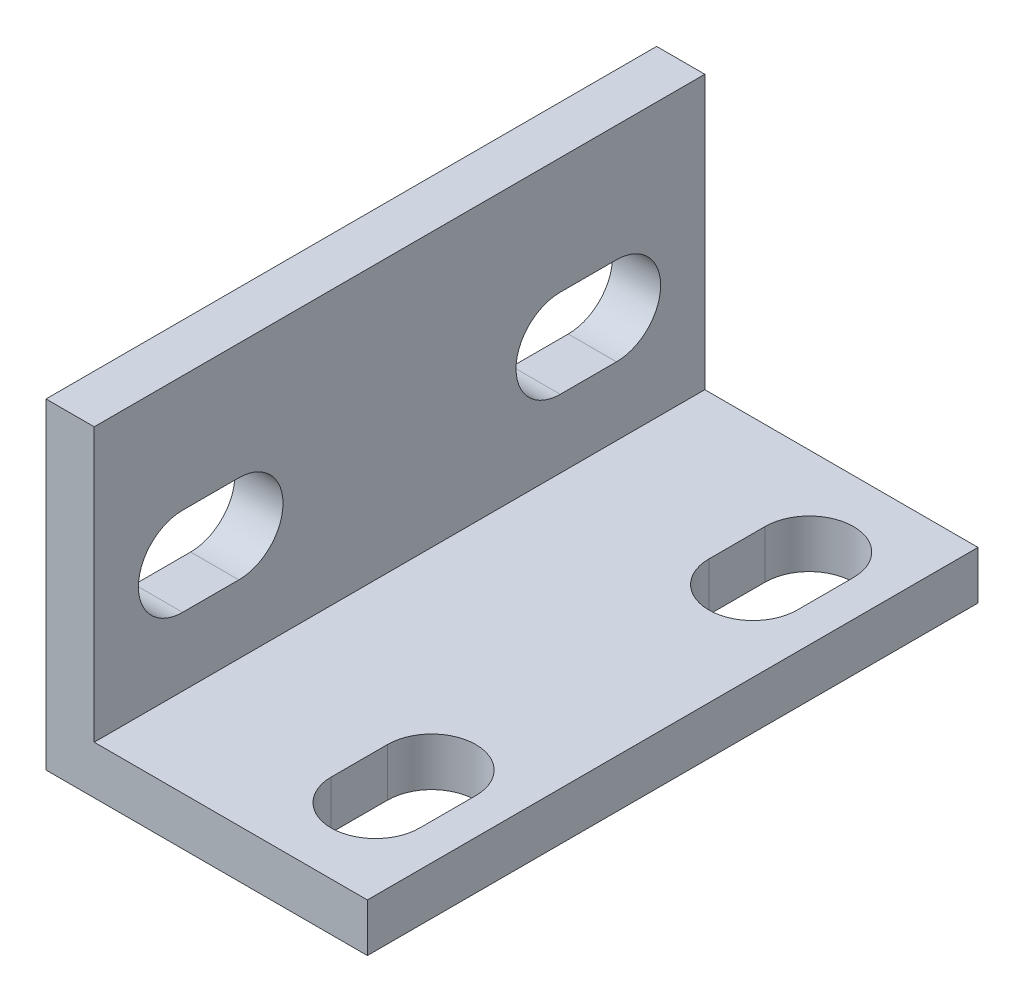
ISO-10303-21;
HEADER;
FILE_DESCRIPTION(('STEP AP214'),'2;1');
FILE_NAME('part.step','',(''),(''),'','','');
FILE_SCHEMA(('AUTOMOTIVE_DESIGN { 1 0 10303 214 1 1 1 1 }'));
ENDSEC;
DATA;
#1=APPLICATION_CONTEXT('core data for automotive mechanical design processes');
#2=APPLICATION_PROTOCOL_DEFINITION('international standard','automotive_design',2000,#1);
#3=PRODUCT_CONTEXT('',#1,'mechanical');
#4=PRODUCT('Part','Part','',(#3));
#5=PRODUCT_RELATED_PRODUCT_CATEGORY('part','',(#4));
#6=PRODUCT_DEFINITION_FORMATION('','',#4);
#7=PRODUCT_DEFINITION_CONTEXT('part definition',#1,'design');
#8=PRODUCT_DEFINITION('design','',#6,#7);
#9=PRODUCT_DEFINITION_SHAPE('','',#8);
#10=(LENGTH_UNIT() NAMED_UNIT(*) SI_UNIT(.MILLI.,.METRE.));
#11=(NAMED_UNIT(*) PLANE_ANGLE_UNIT() SI_UNIT($,.RADIAN.));
#12=(NAMED_UNIT(*) SI_UNIT($,.STERADIAN.) SOLID_ANGLE_UNIT());
#13=UNCERTAINTY_MEASURE_WITH_UNIT(LENGTH_MEASURE(1.E-05),#10,'distance_accuracy_value','');
#14=(GEOMETRIC_REPRESENTATION_CONTEXT(3) GLOBAL_UNCERTAINTY_ASSIGNED_CONTEXT((#13)) GLOBAL_UNIT_ASSIGNED_CONTEXT((#10,
#11,#12)) REPRESENTATION_CONTEXT('',''));
#15=CARTESIAN_POINT('',(0.,0.,0.));
#16=DIRECTION('',(0.,0.,1.));
#17=DIRECTION('',(1.,0.,0.));
#18=AXIS2_PLACEMENT_3D('',#15,#16,#17);
#19=CARTESIAN_POINT('',(12.25,0.,5.5));
#20=DIRECTION('',(-1.,0.,0.));
#21=DIRECTION('',(0.,0.,1.));
#22=AXIS2_PLACEMENT_3D('',#19,#20,#21);
#23=PLANE('',#22);
#24=DIRECTION('',(0.,0.,1.));
#25=VECTOR('',#24,1.);
#26=CARTESIAN_POINT('',(12.25,3.,5.5));
#27=LINE('',#26,#25);
#28=CARTESIAN_POINT('',(12.25,3.,5.5));
#29=VERTEX_POINT('',#28);
#30=CARTESIAN_POINT('',(12.25,3.,9.));
#31=VERTEX_POINT('',#30);
#32=EDGE_CURVE('E339',#29,#31,#27,.T.);
#33=ORIENTED_EDGE('',*,*,#32,.T.);
#34=DIRECTION('',(0.,1.,0.));
#35=VECTOR('',#34,1.);
#36=CARTESIAN_POINT('',(12.25,0.,9.));
#37=LINE('',#36,#35);
#38=CARTESIAN_POINT('',(12.25,0.,9.));
#39=VERTEX_POINT('',#38);
#40=EDGE_CURVE('E11',#39,#31,#37,.T.);
#41=ORIENTED_EDGE('',*,*,#40,.F.);
#42=DIRECTION('',(0.,0.,1.));
#43=VECTOR('',#42,1.);
#44=CARTESIAN_POINT('',(12.25,0.,5.5));
#45=LINE('',#44,#43);
#46=CARTESIAN_POINT('',(12.25,0.,5.5));
#47=VERTEX_POINT('',#46);
#48=EDGE_CURVE('E285',#47,#39,#45,.T.);
#49=ORIENTED_EDGE('',*,*,#48,.F.);
#50=DIRECTION('',(0.,1.,0.));
#51=VECTOR('',#50,1.);
#52=CARTESIAN_POINT('',(12.25,0.,5.5));
#53=LINE('',#52,#51);
#54=EDGE_CURVE('E453',#47,#29,#53,.T.);
#55=ORIENTED_EDGE('',*,*,#54,.T.);
#56=EDGE_LOOP('',(#33,#41,#49,#55));
#57=FACE_BOUND('',#56,.T.);
#58=ADVANCED_FACE('F17',(#57),#23,.F.);
#59=CARTESIAN_POINT('',(15.,0.,9.));
#60=DIRECTION('',(0.,1.,0.));
#61=DIRECTION('',(0.,0.,1.));
#62=AXIS2_PLACEMENT_3D('',#59,#60,#61);
#63=CYLINDRICAL_SURFACE('',#62,2.75);
#64=CARTESIAN_POINT('',(15.,3.,9.));
#65=DIRECTION('',(0.,1.,0.));
#66=DIRECTION('',(0.,0.,-1.));
#67=AXIS2_PLACEMENT_3D('',#64,#65,#66);
#68=CIRCLE('',#67,2.75);
#69=CARTESIAN_POINT('',(17.75,3.,9.));
#70=VERTEX_POINT('',#69);
#71=EDGE_CURVE('E261',#31,#70,#68,.T.);
#72=ORIENTED_EDGE('',*,*,#71,.T.);
#73=DIRECTION('',(0.,1.,0.));
#74=VECTOR('',#73,1.);
#75=CARTESIAN_POINT('',(17.75,0.,9.));
#76=LINE('',#75,#74);
#77=CARTESIAN_POINT('',(17.75,0.,9.));
#78=VERTEX_POINT('',#77);
#79=EDGE_CURVE('E26',#78,#70,#76,.T.);
#80=ORIENTED_EDGE('',*,*,#79,.F.);
#81=CARTESIAN_POINT('',(15.,0.,9.));
#82=DIRECTION('',(0.,1.,0.));
#83=DIRECTION('',(0.,0.,-1.));
#84=AXIS2_PLACEMENT_3D('',#81,#82,#83);
#85=CIRCLE('',#84,2.75);
#86=EDGE_CURVE('E289',#39,#78,#85,.T.);
#87=ORIENTED_EDGE('',*,*,#86,.F.);
#88=ORIENTED_EDGE('',*,*,#40,.T.);
#89=EDGE_LOOP('',(#72,#80,#87,#88));
#90=FACE_BOUND('',#89,.T.);
#91=ADVANCED_FACE('F476',(#90),#63,.F.);
#92=CARTESIAN_POINT('',(17.75,0.,5.5));
#93=DIRECTION('',(1.,0.,0.));
#94=DIRECTION('',(0.,1.,0.));
#95=AXIS2_PLACEMENT_3D('',#92,#93,#94);
#96=PLANE('',#95);
#97=DIRECTION('',(0.,0.,-1.));
#98=VECTOR('',#97,1.);
#99=CARTESIAN_POINT('',(17.75,3.,9.));
#100=LINE('',#99,#98);
#101=CARTESIAN_POINT('',(17.75,3.,5.5));
#102=VERTEX_POINT('',#101);
#103=EDGE_CURVE('E258',#70,#102,#100,.T.);
#104=ORIENTED_EDGE('',*,*,#103,.T.);
#105=DIRECTION('',(0.,1.,0.));
#106=VECTOR('',#105,1.);
#107=CARTESIAN_POINT('',(17.75,0.,5.5));
#108=LINE('',#107,#106);
#109=CARTESIAN_POINT('',(17.75,0.,5.5));
#110=VERTEX_POINT('',#109);
#111=EDGE_CURVE('E20',#110,#102,#108,.T.);
#112=ORIENTED_EDGE('',*,*,#111,.F.);
#113=DIRECTION('',(0.,0.,-1.));
#114=VECTOR('',#113,1.);
#115=CARTESIAN_POINT('',(17.75,0.,9.));
#116=LINE('',#115,#114);
#117=EDGE_CURVE('E240',#78,#110,#116,.T.);
#118=ORIENTED_EDGE('',*,*,#117,.F.);
#119=ORIENTED_EDGE('',*,*,#79,.T.);
#120=EDGE_LOOP('',(#104,#112,#118,#119));
#121=FACE_BOUND('',#120,.T.);
#122=ADVANCED_FACE('F469',(#121),#96,.F.);
#123=CARTESIAN_POINT('',(15.,0.,5.5));
#124=DIRECTION('',(0.,1.,0.));
#125=DIRECTION('',(0.,0.,-1.));
#126=AXIS2_PLACEMENT_3D('',#123,#124,#125);
#127=CYLINDRICAL_SURFACE('',#126,2.75);
#128=CARTESIAN_POINT('',(15.,3.,5.5));
#129=DIRECTION('',(0.,1.,0.));
#130=DIRECTION('',(0.,0.,-1.));
#131=AXIS2_PLACEMENT_3D('',#128,#129,#130);
#132=CIRCLE('',#131,2.75);
#133=EDGE_CURVE('E262',#102,#29,#132,.T.);
#134=ORIENTED_EDGE('',*,*,#133,.T.);
#135=ORIENTED_EDGE('',*,*,#54,.F.);
#136=CARTESIAN_POINT('',(15.,0.,5.5));
#137=DIRECTION('',(0.,1.,0.));
#138=DIRECTION('',(0.,0.,-1.));
#139=AXIS2_PLACEMENT_3D('',#136,#137,#138);
#140=CIRCLE('',#139,2.75);
#141=EDGE_CURVE('E284',#110,#47,#140,.T.);
#142=ORIENTED_EDGE('',*,*,#141,.F.);
#143=ORIENTED_EDGE('',*,*,#111,.T.);
#144=EDGE_LOOP('',(#134,#135,#142,#143));
#145=FACE_BOUND('',#144,.T.);
#146=ADVANCED_FACE('F464',(#145),#127,.F.);
#147=CARTESIAN_POINT('',(17.75,0.,32.5));
#148=DIRECTION('',(1.,0.,0.));
#149=DIRECTION('',(0.,1.,0.));
#150=AXIS2_PLACEMENT_3D('',#147,#148,#149);
#151=PLANE('',#150);
#152=DIRECTION('',(0.,0.,-1.));
#153=VECTOR('',#152,1.);
#154=CARTESIAN_POINT('',(17.75,3.,32.5));
#155=LINE('',#154,#153);
#156=CARTESIAN_POINT('',(17.75,3.,32.5));
#157=VERTEX_POINT('',#156);
#158=CARTESIAN_POINT('',(17.75,3.,29.));
#159=VERTEX_POINT('',#158);
#160=EDGE_CURVE('E348',#157,#159,#155,.T.);
#161=ORIENTED_EDGE('',*,*,#160,.T.);
#162=DIRECTION('',(0.,1.,0.));
#163=VECTOR('',#162,1.);
#164=CARTESIAN_POINT('',(17.75,0.,29.));
#165=LINE('',#164,#163);
#166=CARTESIAN_POINT('',(17.75,0.,29.));
#167=VERTEX_POINT('',#166);
#168=EDGE_CURVE('E451',#167,#159,#165,.T.);
#169=ORIENTED_EDGE('',*,*,#168,.F.);
#170=DIRECTION('',(0.,0.,-1.));
#171=VECTOR('',#170,1.);
#172=CARTESIAN_POINT('',(17.75,0.,32.5));
#173=LINE('',#172,#171);
#174=CARTESIAN_POINT('',(17.75,0.,32.5));
#175=VERTEX_POINT('',#174);
#176=EDGE_CURVE('E257',#175,#167,#173,.T.);
#177=ORIENTED_EDGE('',*,*,#176,.F.);
#178=DIRECTION('',(0.,1.,0.));
#179=VECTOR('',#178,1.);
#180=CARTESIAN_POINT('',(17.75,0.,32.5));
#181=LINE('',#180,#179);
#182=EDGE_CURVE('E431',#175,#157,#181,.T.);
#183=ORIENTED_EDGE('',*,*,#182,.T.);
#184=EDGE_LOOP('',(#161,#169,#177,#183));
#185=FACE_BOUND('',#184,.T.);
#186=ADVANCED_FACE('F500',(#185),#151,.F.);
#187=CARTESIAN_POINT('',(15.,0.,29.));
#188=DIRECTION('',(0.,1.,0.));
#189=DIRECTION('',(0.,0.,-1.));
#190=AXIS2_PLACEMENT_3D('',#187,#188,#189);
#191=CYLINDRICAL_SURFACE('',#190,2.75);
#192=CARTESIAN_POINT('',(15.,3.,29.));
#193=DIRECTION('',(0.,1.,0.));
#194=DIRECTION('',(0.,0.,1.));
#195=AXIS2_PLACEMENT_3D('',#192,#193,#194);
#196=CIRCLE('',#195,2.75);
#197=CARTESIAN_POINT('',(12.25,3.,29.));
#198=VERTEX_POINT('',#197);
#199=EDGE_CURVE('E359',#159,#198,#196,.T.);
#200=ORIENTED_EDGE('',*,*,#199,.T.);
#201=DIRECTION('',(0.,1.,0.));
#202=VECTOR('',#201,1.);
#203=CARTESIAN_POINT('',(12.25,0.,29.));
#204=LINE('',#203,#202);
#205=CARTESIAN_POINT('',(12.25,0.,29.));
#206=VERTEX_POINT('',#205);
#207=EDGE_CURVE('E430',#206,#198,#204,.T.);
#208=ORIENTED_EDGE('',*,*,#207,.F.);
#209=CARTESIAN_POINT('',(15.,0.,29.));
#210=DIRECTION('',(0.,1.,0.));
#211=DIRECTION('',(0.,0.,1.));
#212=AXIS2_PLACEMENT_3D('',#209,#210,#211);
#213=CIRCLE('',#212,2.75);
#214=EDGE_CURVE('E254',#167,#206,#213,.T.);
#215=ORIENTED_EDGE('',*,*,#214,.F.);
#216=ORIENTED_EDGE('',*,*,#168,.T.);
#217=EDGE_LOOP('',(#200,#208,#215,#216));
#218=FACE_BOUND('',#217,.T.);
#219=ADVANCED_FACE('F503',(#218),#191,.F.);
#220=CARTESIAN_POINT('',(12.25,0.,32.5));
#221=DIRECTION('',(-1.,0.,0.));
#222=DIRECTION('',(0.,1.,0.));
#223=AXIS2_PLACEMENT_3D('',#220,#221,#222);
#224=PLANE('',#223);
#225=DIRECTION('',(0.,0.,1.));
#226=VECTOR('',#225,1.);
#227=CARTESIAN_POINT('',(12.25,3.,29.));
#228=LINE('',#227,#226);
#229=CARTESIAN_POINT('',(12.25,3.,32.5));
#230=VERTEX_POINT('',#229);
#231=EDGE_CURVE('E352',#198,#230,#228,.T.);
#232=ORIENTED_EDGE('',*,*,#231,.T.);
#233=DIRECTION('',(0.,1.,0.));
#234=VECTOR('',#233,1.);
#235=CARTESIAN_POINT('',(12.25,0.,32.5));
#236=LINE('',#235,#234);
#237=CARTESIAN_POINT('',(12.25,0.,32.5));
#238=VERTEX_POINT('',#237);
#239=EDGE_CURVE('E427',#238,#230,#236,.T.);
#240=ORIENTED_EDGE('',*,*,#239,.F.);
#241=DIRECTION('',(0.,0.,1.));
#242=VECTOR('',#241,1.);
#243=CARTESIAN_POINT('',(12.25,0.,29.));
#244=LINE('',#243,#242);
#245=EDGE_CURVE('E301',#206,#238,#244,.T.);
#246=ORIENTED_EDGE('',*,*,#245,.F.);
#247=ORIENTED_EDGE('',*,*,#207,.T.);
#248=EDGE_LOOP('',(#232,#240,#246,#247));
#249=FACE_BOUND('',#248,.T.);
#250=ADVANCED_FACE('F507',(#249),#224,.F.);
#251=CARTESIAN_POINT('',(15.,0.,32.5));
#252=DIRECTION('',(0.,1.,0.));
#253=DIRECTION('',(0.,0.,1.));
#254=AXIS2_PLACEMENT_3D('',#251,#252,#253);
#255=CYLINDRICAL_SURFACE('',#254,2.75);
#256=CARTESIAN_POINT('',(15.,3.,32.5));
#257=DIRECTION('',(0.,1.,0.));
#258=DIRECTION('',(0.,0.,1.));
#259=AXIS2_PLACEMENT_3D('',#256,#257,#258);
#260=CIRCLE('',#259,2.75);
#261=EDGE_CURVE('E343',#230,#157,#260,.T.);
#262=ORIENTED_EDGE('',*,*,#261,.T.);
#263=ORIENTED_EDGE('',*,*,#182,.F.);
#264=CARTESIAN_POINT('',(15.,0.,32.5));
#265=DIRECTION('',(0.,1.,0.));
#266=DIRECTION('',(0.,0.,1.));
#267=AXIS2_PLACEMENT_3D('',#264,#265,#266);
#268=CIRCLE('',#267,2.75);
#269=EDGE_CURVE('E280',#238,#175,#268,.T.);
#270=ORIENTED_EDGE('',*,*,#269,.F.);
#271=ORIENTED_EDGE('',*,*,#239,.T.);
#272=EDGE_LOOP('',(#262,#263,#270,#271));
#273=FACE_BOUND('',#272,.T.);
#274=ADVANCED_FACE('F511',(#273),#255,.F.);
#275=CARTESIAN_POINT('',(0.,7.25,9.));
#276=DIRECTION('',(0.,-1.,0.));
#277=DIRECTION('',(0.,0.,-1.));
#278=AXIS2_PLACEMENT_3D('',#275,#276,#277);
#279=PLANE('',#278);
#280=DIRECTION('',(0.,0.,-1.));
#281=VECTOR('',#280,1.);
#282=CARTESIAN_POINT('',(3.,7.25,9.));
#283=LINE('',#282,#281);
#284=CARTESIAN_POINT('',(3.,7.25,9.));
#285=VERTEX_POINT('',#284);
#286=CARTESIAN_POINT('',(3.,7.25,5.5));
#287=VERTEX_POINT('',#286);
#288=EDGE_CURVE('E264',#285,#287,#283,.T.);
#289=ORIENTED_EDGE('',*,*,#288,.T.);
#290=DIRECTION('',(1.,0.,0.));
#291=VECTOR('',#290,1.);
#292=CARTESIAN_POINT('',(0.,7.25,5.5));
#293=LINE('',#292,#291);
#294=CARTESIAN_POINT('',(0.,7.25,5.5));
#295=VERTEX_POINT('',#294);
#296=EDGE_CURVE('E444',#295,#287,#293,.T.);
#297=ORIENTED_EDGE('',*,*,#296,.F.);
#298=DIRECTION('',(0.,0.,-1.));
#299=VECTOR('',#298,1.);
#300=CARTESIAN_POINT('',(0.,7.25,9.));
#301=LINE('',#300,#299);
#302=CARTESIAN_POINT('',(0.,7.25,9.));
#303=VERTEX_POINT('',#302);
#304=EDGE_CURVE('E404',#303,#295,#301,.T.);
#305=ORIENTED_EDGE('',*,*,#304,.F.);
#306=DIRECTION('',(1.,0.,0.));
#307=VECTOR('',#306,1.);
#308=CARTESIAN_POINT('',(0.,7.25,9.));
#309=LINE('',#308,#307);
#310=EDGE_CURVE('E331',#303,#285,#309,.T.);
#311=ORIENTED_EDGE('',*,*,#310,.T.);
#312=EDGE_LOOP('',(#289,#297,#305,#311));
#313=FACE_BOUND('',#312,.T.);
#314=ADVANCED_FACE('F515',(#313),#279,.F.);
#315=CARTESIAN_POINT('',(0.,10.,5.5));
#316=DIRECTION('',(1.,0.,0.));
#317=DIRECTION('',(0.,0.,-1.));
#318=AXIS2_PLACEMENT_3D('',#315,#316,#317);
#319=CYLINDRICAL_SURFACE('',#318,2.75);
#320=CARTESIAN_POINT('',(3.,10.,5.5));
#321=DIRECTION('',(1.,0.,0.));
#322=DIRECTION('',(0.,0.,1.));
#323=AXIS2_PLACEMENT_3D('',#320,#321,#322);
#324=CIRCLE('',#323,2.75);
#325=CARTESIAN_POINT('',(3.,12.75,5.5));
#326=VERTEX_POINT('',#325);
#327=EDGE_CURVE('E269',#287,#326,#324,.T.);
#328=ORIENTED_EDGE('',*,*,#327,.T.);
#329=DIRECTION('',(1.,0.,0.));
#330=VECTOR('',#329,1.);
#331=CARTESIAN_POINT('',(0.,12.75,5.5));
#332=LINE('',#331,#330);
#333=CARTESIAN_POINT('',(0.,12.75,5.5));
#334=VERTEX_POINT('',#333);
#335=EDGE_CURVE('E439',#334,#326,#332,.T.);
#336=ORIENTED_EDGE('',*,*,#335,.F.);
#337=CARTESIAN_POINT('',(0.,10.,5.5));
#338=DIRECTION('',(1.,0.,0.));
#339=DIRECTION('',(0.,0.,1.));
#340=AXIS2_PLACEMENT_3D('',#337,#338,#339);
#341=CIRCLE('',#340,2.75);
#342=EDGE_CURVE('E408',#295,#334,#341,.T.);
#343=ORIENTED_EDGE('',*,*,#342,.F.);
#344=ORIENTED_EDGE('',*,*,#296,.T.);
#345=EDGE_LOOP('',(#328,#336,#343,#344));
#346=FACE_BOUND('',#345,.T.);
#347=ADVANCED_FACE('F521',(#346),#319,.F.);
#348=CARTESIAN_POINT('',(0.,12.75,9.));
#349=DIRECTION('',(0.,1.,0.));
#350=DIRECTION('',(1.,0.,0.));
#351=AXIS2_PLACEMENT_3D('',#348,#349,#350);
#352=PLANE('',#351);
#353=DIRECTION('',(0.,0.,1.));
#354=VECTOR('',#353,1.);
#355=CARTESIAN_POINT('',(3.,12.75,5.5));
#356=LINE('',#355,#354);
#357=CARTESIAN_POINT('',(3.,12.75,9.));
#358=VERTEX_POINT('',#357);
#359=EDGE_CURVE('E364',#326,#358,#356,.T.);
#360=ORIENTED_EDGE('',*,*,#359,.T.);
#361=DIRECTION('',(1.,0.,0.));
#362=VECTOR('',#361,1.);
#363=CARTESIAN_POINT('',(0.,12.75,9.));
#364=LINE('',#363,#362);
#365=CARTESIAN_POINT('',(0.,12.75,9.));
#366=VERTEX_POINT('',#365);
#367=EDGE_CURVE('E436',#366,#358,#364,.T.);
#368=ORIENTED_EDGE('',*,*,#367,.F.);
#369=DIRECTION('',(0.,0.,1.));
#370=VECTOR('',#369,1.);
#371=CARTESIAN_POINT('',(0.,12.75,5.5));
#372=LINE('',#371,#370);
#373=EDGE_CURVE('E355',#334,#366,#372,.T.);
#374=ORIENTED_EDGE('',*,*,#373,.F.);
#375=ORIENTED_EDGE('',*,*,#335,.T.);
#376=EDGE_LOOP('',(#360,#368,#374,#375));
#377=FACE_BOUND('',#376,.T.);
#378=ADVANCED_FACE('F517',(#377),#352,.F.);
#379=CARTESIAN_POINT('',(0.,10.,9.));
#380=DIRECTION('',(1.,0.,0.));
#381=DIRECTION('',(0.,0.,1.));
#382=AXIS2_PLACEMENT_3D('',#379,#380,#381);
#383=CYLINDRICAL_SURFACE('',#382,2.75);
#384=CARTESIAN_POINT('',(3.,10.,9.));
#385=DIRECTION('',(1.,0.,0.));
#386=DIRECTION('',(0.,0.,1.));
#387=AXIS2_PLACEMENT_3D('',#384,#385,#386);
#388=CIRCLE('',#387,2.75);
#389=EDGE_CURVE('E360',#358,#285,#388,.T.);
#390=ORIENTED_EDGE('',*,*,#389,.T.);
#391=ORIENTED_EDGE('',*,*,#310,.F.);
#392=CARTESIAN_POINT('',(0.,10.,9.));
#393=DIRECTION('',(1.,0.,0.));
#394=DIRECTION('',(0.,0.,1.));
#395=AXIS2_PLACEMENT_3D('',#392,#393,#394);
#396=CIRCLE('',#395,2.75);
#397=EDGE_CURVE('E400',#366,#303,#396,.T.);
#398=ORIENTED_EDGE('',*,*,#397,.F.);
#399=ORIENTED_EDGE('',*,*,#367,.T.);
#400=EDGE_LOOP('',(#390,#391,#398,#399));
#401=FACE_BOUND('',#400,.T.);
#402=ADVANCED_FACE('F520',(#401),#383,.F.);
#403=CARTESIAN_POINT('',(0.,12.75,29.));
#404=DIRECTION('',(0.,1.,0.));
#405=DIRECTION('',(0.,0.,-1.));
#406=AXIS2_PLACEMENT_3D('',#403,#404,#405);
#407=PLANE('',#406);
#408=DIRECTION('',(0.,0.,1.));
#409=VECTOR('',#408,1.);
#410=CARTESIAN_POINT('',(3.,12.75,29.));
#411=LINE('',#410,#409);
#412=CARTESIAN_POINT('',(3.,12.75,29.));
#413=VERTEX_POINT('',#412);
#414=CARTESIAN_POINT('',(3.,12.75,32.5));
#415=VERTEX_POINT('',#414);
#416=EDGE_CURVE('E322',#413,#415,#411,.T.);
#417=ORIENTED_EDGE('',*,*,#416,.T.);
#418=DIRECTION('',(1.,0.,0.));
#419=VECTOR('',#418,1.);
#420=CARTESIAN_POINT('',(0.,12.75,32.5));
#421=LINE('',#420,#419);
#422=CARTESIAN_POINT('',(0.,12.75,32.5));
#423=VERTEX_POINT('',#422);
#424=EDGE_CURVE('E39',#423,#415,#421,.T.);
#425=ORIENTED_EDGE('',*,*,#424,.F.);
#426=DIRECTION('',(0.,0.,1.));
#427=VECTOR('',#426,1.);
#428=CARTESIAN_POINT('',(0.,12.75,29.));
#429=LINE('',#428,#427);
#430=CARTESIAN_POINT('',(0.,12.75,29.));
#431=VERTEX_POINT('',#430);
#432=EDGE_CURVE('E312',#431,#423,#429,.T.);
#433=ORIENTED_EDGE('',*,*,#432,.F.);
#434=DIRECTION('',(1.,0.,0.));
#435=VECTOR('',#434,1.);
#436=CARTESIAN_POINT('',(0.,12.75,29.));
#437=LINE('',#436,#435);
#438=EDGE_CURVE('E49',#431,#413,#437,.T.);
#439=ORIENTED_EDGE('',*,*,#438,.T.);
#440=EDGE_LOOP('',(#417,#425,#433,#439));
#441=FACE_BOUND('',#440,.T.);
#442=ADVANCED_FACE('F523',(#441),#407,.F.);
#443=CARTESIAN_POINT('',(0.,10.,32.5));
#444=DIRECTION('',(1.,0.,0.));
#445=DIRECTION('',(0.,0.,1.));
#446=AXIS2_PLACEMENT_3D('',#443,#444,#445);
#447=CYLINDRICAL_SURFACE('',#446,2.75);
#448=CARTESIAN_POINT('',(3.,10.,32.5));
#449=DIRECTION('',(1.,0.,0.));
#450=DIRECTION('',(0.,0.,-1.));
#451=AXIS2_PLACEMENT_3D('',#448,#449,#450);
#452=CIRCLE('',#451,2.75);
#453=CARTESIAN_POINT('',(3.,7.25,32.5));
#454=VERTEX_POINT('',#453);
#455=EDGE_CURVE('E318',#415,#454,#452,.T.);
#456=ORIENTED_EDGE('',*,*,#455,.T.);
#457=DIRECTION('',(1.,0.,0.));
#458=VECTOR('',#457,1.);
#459=CARTESIAN_POINT('',(0.,7.25,32.5));
#460=LINE('',#459,#458);
#461=CARTESIAN_POINT('',(0.,7.25,32.5));
#462=VERTEX_POINT('',#461);
#463=EDGE_CURVE('E332',#462,#454,#460,.T.);
#464=ORIENTED_EDGE('',*,*,#463,.F.);
#465=CARTESIAN_POINT('',(0.,10.,32.5));
#466=DIRECTION('',(1.,0.,0.));
#467=DIRECTION('',(0.,0.,-1.));
#468=AXIS2_PLACEMENT_3D('',#465,#466,#467);
#469=CIRCLE('',#468,2.75);
#470=EDGE_CURVE('E316',#423,#462,#469,.T.);
#471=ORIENTED_EDGE('',*,*,#470,.F.);
#472=ORIENTED_EDGE('',*,*,#424,.T.);
#473=EDGE_LOOP('',(#456,#464,#471,#472));
#474=FACE_BOUND('',#473,.T.);
#475=ADVANCED_FACE('F526',(#474),#447,.F.);
#476=CARTESIAN_POINT('',(0.,7.25,29.));
#477=DIRECTION('',(0.,-1.,0.));
#478=DIRECTION('',(0.,0.,-1.));
#479=AXIS2_PLACEMENT_3D('',#476,#477,#478);
#480=PLANE('',#479);
#481=DIRECTION('',(0.,0.,-1.));
#482=VECTOR('',#481,1.);
#483=CARTESIAN_POINT('',(3.,7.25,32.5));
#484=LINE('',#483,#482);
#485=CARTESIAN_POINT('',(3.,7.25,29.));
#486=VERTEX_POINT('',#485);
#487=EDGE_CURVE('E323',#454,#486,#484,.T.);
#488=ORIENTED_EDGE('',*,*,#487,.T.);
#489=DIRECTION('',(1.,0.,0.));
#490=VECTOR('',#489,1.);
#491=CARTESIAN_POINT('',(0.,7.25,29.));
#492=LINE('',#491,#490);
#493=CARTESIAN_POINT('',(0.,7.25,29.));
#494=VERTEX_POINT('',#493);
#495=EDGE_CURVE('E424',#494,#486,#492,.T.);
#496=ORIENTED_EDGE('',*,*,#495,.F.);
#497=DIRECTION('',(0.,0.,-1.));
#498=VECTOR('',#497,1.);
#499=CARTESIAN_POINT('',(0.,7.25,32.5));
#500=LINE('',#499,#498);
#501=EDGE_CURVE('E412',#462,#494,#500,.T.);
#502=ORIENTED_EDGE('',*,*,#501,.F.);
#503=ORIENTED_EDGE('',*,*,#463,.T.);
#504=EDGE_LOOP('',(#488,#496,#502,#503));
#505=FACE_BOUND('',#504,.T.);
#506=ADVANCED_FACE('F530',(#505),#480,.F.);
#507=CARTESIAN_POINT('',(0.,10.,29.));
#508=DIRECTION('',(1.,0.,0.));
#509=DIRECTION('',(0.,0.,-1.));
#510=AXIS2_PLACEMENT_3D('',#507,#508,#509);
#511=CYLINDRICAL_SURFACE('',#510,2.75);
#512=CARTESIAN_POINT('',(3.,10.,29.));
#513=DIRECTION('',(1.,0.,0.));
#514=DIRECTION('',(0.,0.,-1.));
#515=AXIS2_PLACEMENT_3D('',#512,#513,#514);
#516=CIRCLE('',#515,2.75);
#517=EDGE_CURVE('E268',#486,#413,#516,.T.);
#518=ORIENTED_EDGE('',*,*,#517,.T.);
#519=ORIENTED_EDGE('',*,*,#438,.F.);
#520=CARTESIAN_POINT('',(0.,10.,29.));
#521=DIRECTION('',(1.,0.,0.));
#522=DIRECTION('',(0.,0.,-1.));
#523=AXIS2_PLACEMENT_3D('',#520,#521,#522);
#524=CIRCLE('',#523,2.75);
#525=EDGE_CURVE('E317',#494,#431,#524,.T.);
#526=ORIENTED_EDGE('',*,*,#525,.F.);
#527=ORIENTED_EDGE('',*,*,#495,.T.);
#528=EDGE_LOOP('',(#518,#519,#526,#527));
#529=FACE_BOUND('',#528,.T.);
#530=ADVANCED_FACE('F533',(#529),#511,.F.);
#531=CARTESIAN_POINT('',(0.,0.,0.));
#532=DIRECTION('',(0.,0.,-1.));
#533=DIRECTION('',(0.,-1.,0.));
#534=AXIS2_PLACEMENT_3D('',#531,#532,#533);
#535=PLANE('',#534);
#536=DIRECTION('',(1.,0.,0.));
#537=VECTOR('',#536,1.);
#538=CARTESIAN_POINT('',(0.,0.,0.));
#539=LINE('',#538,#537);
#540=CARTESIAN_POINT('',(0.,0.,0.));
#541=VERTEX_POINT('',#540);
#542=CARTESIAN_POINT('',(20.,0.,0.));
#543=VERTEX_POINT('',#542);
#544=EDGE_CURVE('E236',#541,#543,#539,.T.);
#545=ORIENTED_EDGE('',*,*,#544,.F.);
#546=DIRECTION('',(0.,-1.,0.));
#547=VECTOR('',#546,1.);
#548=CARTESIAN_POINT('',(0.,20.,0.));
#549=LINE('',#548,#547);
#550=CARTESIAN_POINT('',(0.,20.,0.));
#551=VERTEX_POINT('',#550);
#552=EDGE_CURVE('E218',#551,#541,#549,.T.);
#553=ORIENTED_EDGE('',*,*,#552,.F.);
#554=DIRECTION('',(1.,0.,0.));
#555=VECTOR('',#554,1.);
#556=CARTESIAN_POINT('',(0.,20.,0.));
#557=LINE('',#556,#555);
#558=CARTESIAN_POINT('',(3.,20.,0.));
#559=VERTEX_POINT('',#558);
#560=EDGE_CURVE('E390',#551,#559,#557,.T.);
#561=ORIENTED_EDGE('',*,*,#560,.T.);
#562=DIRECTION('',(0.,-1.,0.));
#563=VECTOR('',#562,1.);
#564=CARTESIAN_POINT('',(3.,3.,0.));
#565=LINE('',#564,#563);
#566=CARTESIAN_POINT('',(3.,3.,0.));
#567=VERTEX_POINT('',#566);
#568=EDGE_CURVE('E344',#559,#567,#565,.T.);
#569=ORIENTED_EDGE('',*,*,#568,.T.);
#570=DIRECTION('',(1.,0.,0.));
#571=VECTOR('',#570,1.);
#572=CARTESIAN_POINT('',(3.,3.,0.));
#573=LINE('',#572,#571);
#574=CARTESIAN_POINT('',(20.,3.,0.));
#575=VERTEX_POINT('',#574);
#576=EDGE_CURVE('E295',#567,#575,#573,.T.);
#577=ORIENTED_EDGE('',*,*,#576,.T.);
#578=DIRECTION('',(0.,-1.,0.));
#579=VECTOR('',#578,1.);
#580=CARTESIAN_POINT('',(20.,3.,0.));
#581=LINE('',#580,#579);
#582=EDGE_CURVE('E244',#575,#543,#581,.T.);
#583=ORIENTED_EDGE('',*,*,#582,.T.);
#584=EDGE_LOOP('',(#545,#553,#561,#569,#577,#583));
#585=FACE_BOUND('',#584,.T.);
#586=ADVANCED_FACE('F242',(#585),#535,.T.);
#587=CARTESIAN_POINT('',(0.,0.,38.));
#588=DIRECTION('',(0.,0.,-1.));
#589=DIRECTION('',(0.,-1.,0.));
#590=AXIS2_PLACEMENT_3D('',#587,#588,#589);
#591=PLANE('',#590);
#592=DIRECTION('',(1.,0.,0.));
#593=VECTOR('',#592,1.);
#594=CARTESIAN_POINT('',(0.,0.,38.));
#595=LINE('',#594,#593);
#596=CARTESIAN_POINT('',(0.,0.,38.));
#597=VERTEX_POINT('',#596);
#598=CARTESIAN_POINT('',(20.,0.,38.));
#599=VERTEX_POINT('',#598);
#600=EDGE_CURVE('E238',#597,#599,#595,.T.);
#601=ORIENTED_EDGE('',*,*,#600,.T.);
#602=DIRECTION('',(0.,-1.,0.));
#603=VECTOR('',#602,1.);
#604=CARTESIAN_POINT('',(20.,3.,38.));
#605=LINE('',#604,#603);
#606=CARTESIAN_POINT('',(20.,3.,38.));
#607=VERTEX_POINT('',#606);
#608=EDGE_CURVE('E275',#607,#599,#605,.T.);
#609=ORIENTED_EDGE('',*,*,#608,.F.);
#610=DIRECTION('',(1.,0.,0.));
#611=VECTOR('',#610,1.);
#612=CARTESIAN_POINT('',(3.,3.,38.));
#613=LINE('',#612,#611);
#614=CARTESIAN_POINT('',(3.,3.,38.));
#615=VERTEX_POINT('',#614);
#616=EDGE_CURVE('E294',#615,#607,#613,.T.);
#617=ORIENTED_EDGE('',*,*,#616,.F.);
#618=DIRECTION('',(0.,-1.,0.));
#619=VECTOR('',#618,1.);
#620=CARTESIAN_POINT('',(3.,3.,38.));
#621=LINE('',#620,#619);
#622=CARTESIAN_POINT('',(3.,20.,38.));
#623=VERTEX_POINT('',#622);
#624=EDGE_CURVE('E365',#623,#615,#621,.T.);
#625=ORIENTED_EDGE('',*,*,#624,.F.);
#626=DIRECTION('',(1.,0.,0.));
#627=VECTOR('',#626,1.);
#628=CARTESIAN_POINT('',(0.,20.,38.));
#629=LINE('',#628,#627);
#630=CARTESIAN_POINT('',(0.,20.,38.));
#631=VERTEX_POINT('',#630);
#632=EDGE_CURVE('E230',#631,#623,#629,.T.);
#633=ORIENTED_EDGE('',*,*,#632,.F.);
#634=DIRECTION('',(0.,-1.,0.));
#635=VECTOR('',#634,1.);
#636=CARTESIAN_POINT('',(0.,20.,38.));
#637=LINE('',#636,#635);
#638=EDGE_CURVE('E229',#631,#597,#637,.T.);
#639=ORIENTED_EDGE('',*,*,#638,.T.);
#640=EDGE_LOOP('',(#601,#609,#617,#625,#633,#639));
#641=FACE_BOUND('',#640,.T.);
#642=ADVANCED_FACE('F547',(#641),#591,.F.);
#643=CARTESIAN_POINT('',(0.,20.,38.));
#644=DIRECTION('',(1.,0.,0.));
#645=DIRECTION('',(0.,1.,0.));
#646=AXIS2_PLACEMENT_3D('',#643,#644,#645);
#647=PLANE('',#646);
#648=ORIENTED_EDGE('',*,*,#501,.T.);
#649=ORIENTED_EDGE('',*,*,#525,.T.);
#650=ORIENTED_EDGE('',*,*,#432,.T.);
#651=ORIENTED_EDGE('',*,*,#470,.T.);
#652=EDGE_LOOP('',(#648,#649,#650,#651));
#653=FACE_BOUND('',#652,.T.);
#654=ORIENTED_EDGE('',*,*,#373,.T.);
#655=ORIENTED_EDGE('',*,*,#397,.T.);
#656=ORIENTED_EDGE('',*,*,#304,.T.);
#657=ORIENTED_EDGE('',*,*,#342,.T.);
#658=EDGE_LOOP('',(#654,#655,#656,#657));
#659=FACE_BOUND('',#658,.T.);
#660=ORIENTED_EDGE('',*,*,#552,.T.);
#661=DIRECTION('',(0.,0.,-1.));
#662=VECTOR('',#661,1.);
#663=CARTESIAN_POINT('',(0.,0.,38.));
#664=LINE('',#663,#662);
#665=EDGE_CURVE('E221',#597,#541,#664,.T.);
#666=ORIENTED_EDGE('',*,*,#665,.F.);
#667=ORIENTED_EDGE('',*,*,#638,.F.);
#668=DIRECTION('',(0.,0.,-1.));
#669=VECTOR('',#668,1.);
#670=CARTESIAN_POINT('',(0.,20.,38.));
#671=LINE('',#670,#669);
#672=EDGE_CURVE('E224',#631,#551,#671,.T.);
#673=ORIENTED_EDGE('',*,*,#672,.T.);
#674=EDGE_LOOP('',(#660,#666,#667,#673));
#675=FACE_BOUND('',#674,.T.);
#676=ADVANCED_FACE('F220',(#653,#659,#675),#647,.F.);
#677=CARTESIAN_POINT('',(0.,20.,38.));
#678=DIRECTION('',(0.,1.,0.));
#679=DIRECTION('',(1.,0.,0.));
#680=AXIS2_PLACEMENT_3D('',#677,#678,#679);
#681=PLANE('',#680);
#682=ORIENTED_EDGE('',*,*,#560,.F.);
#683=ORIENTED_EDGE('',*,*,#672,.F.);
#684=ORIENTED_EDGE('',*,*,#632,.T.);
#685=DIRECTION('',(0.,0.,-1.));
#686=VECTOR('',#685,1.);
#687=CARTESIAN_POINT('',(3.,20.,38.));
#688=LINE('',#687,#686);
#689=EDGE_CURVE('E347',#623,#559,#688,.T.);
#690=ORIENTED_EDGE('',*,*,#689,.T.);
#691=EDGE_LOOP('',(#682,#683,#684,#690));
#692=FACE_BOUND('',#691,.T.);
#693=ADVANCED_FACE('F537',(#692),#681,.T.);
#694=CARTESIAN_POINT('',(3.,20.,38.));
#695=DIRECTION('',(1.,0.,0.));
#696=DIRECTION('',(0.,1.,0.));
#697=AXIS2_PLACEMENT_3D('',#694,#695,#696);
#698=PLANE('',#697);
#699=ORIENTED_EDGE('',*,*,#517,.F.);
#700=ORIENTED_EDGE('',*,*,#487,.F.);
#701=ORIENTED_EDGE('',*,*,#455,.F.);
#702=ORIENTED_EDGE('',*,*,#416,.F.);
#703=EDGE_LOOP('',(#699,#700,#701,#702));
#704=FACE_BOUND('',#703,.T.);
#705=ORIENTED_EDGE('',*,*,#389,.F.);
#706=ORIENTED_EDGE('',*,*,#359,.F.);
#707=ORIENTED_EDGE('',*,*,#327,.F.);
#708=ORIENTED_EDGE('',*,*,#288,.F.);
#709=EDGE_LOOP('',(#705,#706,#707,#708));
#710=FACE_BOUND('',#709,.T.);
#711=ORIENTED_EDGE('',*,*,#568,.F.);
#712=ORIENTED_EDGE('',*,*,#689,.F.);
#713=ORIENTED_EDGE('',*,*,#624,.T.);
#714=DIRECTION('',(0.,0.,-1.));
#715=VECTOR('',#714,1.);
#716=CARTESIAN_POINT('',(3.,3.,38.));
#717=LINE('',#716,#715);
#718=EDGE_CURVE('E290',#615,#567,#717,.T.);
#719=ORIENTED_EDGE('',*,*,#718,.T.);
#720=EDGE_LOOP('',(#711,#712,#713,#719));
#721=FACE_BOUND('',#720,.T.);
#722=ADVANCED_FACE('F540',(#704,#710,#721),#698,.T.);
#723=CARTESIAN_POINT('',(0.,3.,38.));
#724=DIRECTION('',(0.,1.,0.));
#725=DIRECTION('',(1.,0.,0.));
#726=AXIS2_PLACEMENT_3D('',#723,#724,#725);
#727=PLANE('',#726);
#728=ORIENTED_EDGE('',*,*,#261,.F.);
#729=ORIENTED_EDGE('',*,*,#231,.F.);
#730=ORIENTED_EDGE('',*,*,#199,.F.);
#731=ORIENTED_EDGE('',*,*,#160,.F.);
#732=EDGE_LOOP('',(#728,#729,#730,#731));
#733=FACE_BOUND('',#732,.T.);
#734=ORIENTED_EDGE('',*,*,#133,.F.);
#735=ORIENTED_EDGE('',*,*,#103,.F.);
#736=ORIENTED_EDGE('',*,*,#71,.F.);
#737=ORIENTED_EDGE('',*,*,#32,.F.);
#738=EDGE_LOOP('',(#734,#735,#736,#737));
#739=FACE_BOUND('',#738,.T.);
#740=ORIENTED_EDGE('',*,*,#576,.F.);
#741=ORIENTED_EDGE('',*,*,#718,.F.);
#742=ORIENTED_EDGE('',*,*,#616,.T.);
#743=DIRECTION('',(0.,0.,-1.));
#744=VECTOR('',#743,1.);
#745=CARTESIAN_POINT('',(20.,3.,38.));
#746=LINE('',#745,#744);
#747=EDGE_CURVE('E272',#607,#575,#746,.T.);
#748=ORIENTED_EDGE('',*,*,#747,.T.);
#749=EDGE_LOOP('',(#740,#741,#742,#748));
#750=FACE_BOUND('',#749,.T.);
#751=ADVANCED_FACE('F472',(#733,#739,#750),#727,.T.);
#752=CARTESIAN_POINT('',(20.,3.,38.));
#753=DIRECTION('',(1.,0.,0.));
#754=DIRECTION('',(0.,1.,0.));
#755=AXIS2_PLACEMENT_3D('',#752,#753,#754);
#756=PLANE('',#755);
#757=ORIENTED_EDGE('',*,*,#582,.F.);
#758=ORIENTED_EDGE('',*,*,#747,.F.);
#759=ORIENTED_EDGE('',*,*,#608,.T.);
#760=DIRECTION('',(0.,0.,-1.));
#761=VECTOR('',#760,1.);
#762=CARTESIAN_POINT('',(20.,0.,38.));
#763=LINE('',#762,#761);
#764=EDGE_CURVE('E247',#599,#543,#763,.T.);
#765=ORIENTED_EDGE('',*,*,#764,.T.);
#766=EDGE_LOOP('',(#757,#758,#759,#765));
#767=FACE_BOUND('',#766,.T.);
#768=ADVANCED_FACE('F479',(#767),#756,.T.);
#769=CARTESIAN_POINT('',(0.,0.,38.));
#770=DIRECTION('',(0.,1.,0.));
#771=DIRECTION('',(1.,0.,0.));
#772=AXIS2_PLACEMENT_3D('',#769,#770,#771);
#773=PLANE('',#772);
#774=ORIENTED_EDGE('',*,*,#245,.T.);
#775=ORIENTED_EDGE('',*,*,#269,.T.);
#776=ORIENTED_EDGE('',*,*,#176,.T.);
#777=ORIENTED_EDGE('',*,*,#214,.T.);
#778=EDGE_LOOP('',(#774,#775,#776,#777));
#779=FACE_BOUND('',#778,.T.);
#780=ORIENTED_EDGE('',*,*,#117,.T.);
#781=ORIENTED_EDGE('',*,*,#141,.T.);
#782=ORIENTED_EDGE('',*,*,#48,.T.);
#783=ORIENTED_EDGE('',*,*,#86,.T.);
#784=EDGE_LOOP('',(#780,#781,#782,#783));
#785=FACE_BOUND('',#784,.T.);
#786=ORIENTED_EDGE('',*,*,#544,.T.);
#787=ORIENTED_EDGE('',*,*,#764,.F.);
#788=ORIENTED_EDGE('',*,*,#600,.F.);
#789=ORIENTED_EDGE('',*,*,#665,.T.);
#790=EDGE_LOOP('',(#786,#787,#788,#789));
#791=FACE_BOUND('',#790,.T.);
#792=ADVANCED_FACE('F234',(#779,#785,#791),#773,.F.);
#793=CLOSED_SHELL('',(#58,#91,#122,#146,#186,#219,#250,#274,#314,#347,#378,#402,#442,#475,#506,
#530,#586,#642,#676,#693,#722,#751,#768,#792));
#794=MANIFOLD_SOLID_BREP('B1',#793);
#795=ADVANCED_BREP_SHAPE_REPRESENTATION('',(#18,#794),#14);
#796=SHAPE_DEFINITION_REPRESENTATION(#9,#795);
ENDSEC;
END-ISO-10303-21;
